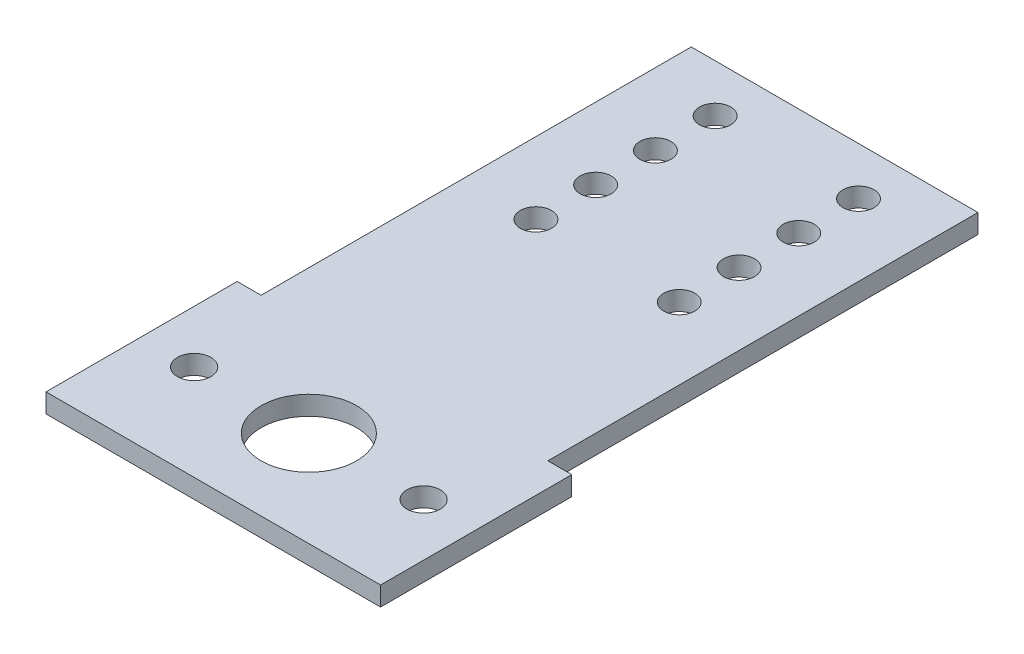
ISO-10303-21;
HEADER;
FILE_DESCRIPTION(('STEP AP214'),'2;1');
FILE_NAME('part.step','',(''),(''),'','','');
FILE_SCHEMA(('AUTOMOTIVE_DESIGN { 1 0 10303 214 1 1 1 1 }'));
ENDSEC;
DATA;
#1=APPLICATION_CONTEXT('core data for automotive mechanical design processes');
#2=APPLICATION_PROTOCOL_DEFINITION('international standard','automotive_design',2000,#1);
#3=PRODUCT_CONTEXT('',#1,'mechanical');
#4=PRODUCT('Part','Part','',(#3));
#5=PRODUCT_RELATED_PRODUCT_CATEGORY('part','',(#4));
#6=PRODUCT_DEFINITION_FORMATION('','',#4);
#7=PRODUCT_DEFINITION_CONTEXT('part definition',#1,'design');
#8=PRODUCT_DEFINITION('design','',#6,#7);
#9=PRODUCT_DEFINITION_SHAPE('','',#8);
#10=(LENGTH_UNIT() NAMED_UNIT(*) SI_UNIT(.MILLI.,.METRE.));
#11=(NAMED_UNIT(*) PLANE_ANGLE_UNIT() SI_UNIT($,.RADIAN.));
#12=(NAMED_UNIT(*) SI_UNIT($,.STERADIAN.) SOLID_ANGLE_UNIT());
#13=UNCERTAINTY_MEASURE_WITH_UNIT(LENGTH_MEASURE(1.E-05),#10,'distance_accuracy_value','');
#14=(GEOMETRIC_REPRESENTATION_CONTEXT(3) GLOBAL_UNCERTAINTY_ASSIGNED_CONTEXT((#13)) GLOBAL_UNIT_ASSIGNED_CONTEXT((#10,
#11,#12)) REPRESENTATION_CONTEXT('',''));
#15=CARTESIAN_POINT('',(0.,0.,0.));
#16=DIRECTION('',(0.,0.,1.));
#17=DIRECTION('',(1.,0.,0.));
#18=AXIS2_PLACEMENT_3D('',#15,#16,#17);
#19=CARTESIAN_POINT('',(-15.,0.,-17.5));
#20=DIRECTION('',(0.,1.,0.));
#21=DIRECTION('',(0.,0.,1.));
#22=AXIS2_PLACEMENT_3D('',#19,#20,#21);
#23=CYLINDRICAL_SURFACE('',#22,3.25);
#24=CARTESIAN_POINT('',(-15.,4.,-17.5));
#25=DIRECTION('',(0.,1.,0.));
#26=DIRECTION('',(0.,0.,1.));
#27=AXIS2_PLACEMENT_3D('',#24,#25,#26);
#28=CIRCLE('',#27,3.25);
#29=CARTESIAN_POINT('',(-15.,4.,-14.25));
#30=VERTEX_POINT('',#29);
#31=EDGE_CURVE('E39',#30,#30,#28,.T.);
#32=ORIENTED_EDGE('',*,*,#31,.T.);
#33=EDGE_LOOP('',(#32));
#34=FACE_BOUND('',#33,.T.);
#35=CARTESIAN_POINT('',(-15.,0.,-17.5));
#36=DIRECTION('',(0.,1.,0.));
#37=DIRECTION('',(0.,0.,1.));
#38=AXIS2_PLACEMENT_3D('',#35,#36,#37);
#39=CIRCLE('',#38,3.25);
#40=CARTESIAN_POINT('',(-15.,0.,-14.25));
#41=VERTEX_POINT('',#40);
#42=EDGE_CURVE('E11',#41,#41,#39,.T.);
#43=ORIENTED_EDGE('',*,*,#42,.F.);
#44=EDGE_LOOP('',(#43));
#45=FACE_BOUND('',#44,.T.);
#46=ADVANCED_FACE('F32',(#34,#45),#23,.F.);
#47=CARTESIAN_POINT('',(-15.,0.,-30.));
#48=DIRECTION('',(0.,1.,0.));
#49=DIRECTION('',(0.,0.,1.));
#50=AXIS2_PLACEMENT_3D('',#47,#48,#49);
#51=CYLINDRICAL_SURFACE('',#50,3.25);
#52=CARTESIAN_POINT('',(-15.,4.,-30.));
#53=DIRECTION('',(0.,1.,0.));
#54=DIRECTION('',(0.,0.,1.));
#55=AXIS2_PLACEMENT_3D('',#52,#53,#54);
#56=CIRCLE('',#55,3.25);
#57=CARTESIAN_POINT('',(-15.,4.,-26.75));
#58=VERTEX_POINT('',#57);
#59=EDGE_CURVE('E163',#58,#58,#56,.T.);
#60=ORIENTED_EDGE('',*,*,#59,.T.);
#61=EDGE_LOOP('',(#60));
#62=FACE_BOUND('',#61,.T.);
#63=CARTESIAN_POINT('',(-15.,0.,-30.));
#64=DIRECTION('',(0.,1.,0.));
#65=DIRECTION('',(0.,0.,1.));
#66=AXIS2_PLACEMENT_3D('',#63,#64,#65);
#67=CIRCLE('',#66,3.25);
#68=CARTESIAN_POINT('',(-15.,0.,-26.75));
#69=VERTEX_POINT('',#68);
#70=EDGE_CURVE('E166',#69,#69,#67,.T.);
#71=ORIENTED_EDGE('',*,*,#70,.F.);
#72=EDGE_LOOP('',(#71));
#73=FACE_BOUND('',#72,.T.);
#74=ADVANCED_FACE('F191',(#62,#73),#51,.F.);
#75=CARTESIAN_POINT('',(15.,0.,-17.5));
#76=DIRECTION('',(0.,1.,0.));
#77=DIRECTION('',(0.,0.,1.));
#78=AXIS2_PLACEMENT_3D('',#75,#76,#77);
#79=CYLINDRICAL_SURFACE('',#78,3.25);
#80=CARTESIAN_POINT('',(15.,4.,-17.5));
#81=DIRECTION('',(0.,1.,0.));
#82=DIRECTION('',(0.,0.,1.));
#83=AXIS2_PLACEMENT_3D('',#80,#81,#82);
#84=CIRCLE('',#83,3.25);
#85=CARTESIAN_POINT('',(15.,4.,-14.25));
#86=VERTEX_POINT('',#85);
#87=EDGE_CURVE('E157',#86,#86,#84,.T.);
#88=ORIENTED_EDGE('',*,*,#87,.T.);
#89=EDGE_LOOP('',(#88));
#90=FACE_BOUND('',#89,.T.);
#91=CARTESIAN_POINT('',(15.,0.,-17.5));
#92=DIRECTION('',(0.,1.,0.));
#93=DIRECTION('',(0.,0.,1.));
#94=AXIS2_PLACEMENT_3D('',#91,#92,#93);
#95=CIRCLE('',#94,3.25);
#96=CARTESIAN_POINT('',(15.,0.,-14.25));
#97=VERTEX_POINT('',#96);
#98=EDGE_CURVE('E160',#97,#97,#95,.T.);
#99=ORIENTED_EDGE('',*,*,#98,.F.);
#100=EDGE_LOOP('',(#99));
#101=FACE_BOUND('',#100,.T.);
#102=ADVANCED_FACE('F195',(#90,#101),#79,.F.);
#103=CARTESIAN_POINT('',(15.,0.,-30.));
#104=DIRECTION('',(0.,1.,0.));
#105=DIRECTION('',(0.,0.,1.));
#106=AXIS2_PLACEMENT_3D('',#103,#104,#105);
#107=CYLINDRICAL_SURFACE('',#106,3.25);
#108=CARTESIAN_POINT('',(15.,4.,-30.));
#109=DIRECTION('',(0.,1.,0.));
#110=DIRECTION('',(0.,0.,1.));
#111=AXIS2_PLACEMENT_3D('',#108,#109,#110);
#112=CIRCLE('',#111,3.25);
#113=CARTESIAN_POINT('',(15.,4.,-26.75));
#114=VERTEX_POINT('',#113);
#115=EDGE_CURVE('E151',#114,#114,#112,.T.);
#116=ORIENTED_EDGE('',*,*,#115,.T.);
#117=EDGE_LOOP('',(#116));
#118=FACE_BOUND('',#117,.T.);
#119=CARTESIAN_POINT('',(15.,0.,-30.));
#120=DIRECTION('',(0.,1.,0.));
#121=DIRECTION('',(0.,0.,1.));
#122=AXIS2_PLACEMENT_3D('',#119,#120,#121);
#123=CIRCLE('',#122,3.25);
#124=CARTESIAN_POINT('',(15.,0.,-26.75));
#125=VERTEX_POINT('',#124);
#126=EDGE_CURVE('E154',#125,#125,#123,.T.);
#127=ORIENTED_EDGE('',*,*,#126,.F.);
#128=EDGE_LOOP('',(#127));
#129=FACE_BOUND('',#128,.T.);
#130=ADVANCED_FACE('F200',(#118,#129),#107,.F.);
#131=CARTESIAN_POINT('',(30.,4.,-65.));
#132=DIRECTION('',(-1.,0.,0.));
#133=DIRECTION('',(0.,0.,1.));
#134=AXIS2_PLACEMENT_3D('',#131,#132,#133);
#135=PLANE('',#134);
#136=DIRECTION('',(0.,1.,0.));
#137=VECTOR('',#136,1.);
#138=CARTESIAN_POINT('',(30.,4.,25.));
#139=LINE('',#138,#137);
#140=CARTESIAN_POINT('',(30.,0.,25.));
#141=VERTEX_POINT('',#140);
#142=CARTESIAN_POINT('',(30.,4.,25.));
#143=VERTEX_POINT('',#142);
#144=EDGE_CURVE('E124',#141,#143,#139,.T.);
#145=ORIENTED_EDGE('',*,*,#144,.F.);
#146=DIRECTION('',(0.,0.,-1.));
#147=VECTOR('',#146,1.);
#148=CARTESIAN_POINT('',(30.,0.,-65.));
#149=LINE('',#148,#147);
#150=CARTESIAN_POINT('',(30.,0.,-65.));
#151=VERTEX_POINT('',#150);
#152=EDGE_CURVE('E131',#141,#151,#149,.T.);
#153=ORIENTED_EDGE('',*,*,#152,.T.);
#154=DIRECTION('',(0.,-1.,0.));
#155=VECTOR('',#154,1.);
#156=CARTESIAN_POINT('',(30.,4.,-65.));
#157=LINE('',#156,#155);
#158=CARTESIAN_POINT('',(30.,4.,-65.));
#159=VERTEX_POINT('',#158);
#160=EDGE_CURVE('E148',#159,#151,#157,.T.);
#161=ORIENTED_EDGE('',*,*,#160,.F.);
#162=DIRECTION('',(0.,0.,-1.));
#163=VECTOR('',#162,1.);
#164=CARTESIAN_POINT('',(30.,4.,-65.));
#165=LINE('',#164,#163);
#166=EDGE_CURVE('E54',#143,#159,#165,.T.);
#167=ORIENTED_EDGE('',*,*,#166,.F.);
#168=EDGE_LOOP('',(#145,#153,#161,#167));
#169=FACE_BOUND('',#168,.T.);
#170=ADVANCED_FACE('F207',(#169),#135,.F.);
#171=CARTESIAN_POINT('',(-30.,4.,-65.));
#172=DIRECTION('',(1.,0.,0.));
#173=DIRECTION('',(0.,0.,-1.));
#174=AXIS2_PLACEMENT_3D('',#171,#172,#173);
#175=PLANE('',#174);
#176=DIRECTION('',(0.,-1.,0.));
#177=VECTOR('',#176,1.);
#178=CARTESIAN_POINT('',(-30.,4.,25.));
#179=LINE('',#178,#177);
#180=CARTESIAN_POINT('',(-30.,4.,25.));
#181=VERTEX_POINT('',#180);
#182=CARTESIAN_POINT('',(-30.,0.,25.));
#183=VERTEX_POINT('',#182);
#184=EDGE_CURVE('E46',#181,#183,#179,.T.);
#185=ORIENTED_EDGE('',*,*,#184,.F.);
#186=DIRECTION('',(0.,0.,1.));
#187=VECTOR('',#186,1.);
#188=CARTESIAN_POINT('',(-30.,4.,-65.));
#189=LINE('',#188,#187);
#190=CARTESIAN_POINT('',(-30.,4.,-65.));
#191=VERTEX_POINT('',#190);
#192=EDGE_CURVE('E104',#191,#181,#189,.T.);
#193=ORIENTED_EDGE('',*,*,#192,.F.);
#194=DIRECTION('',(0.,-1.,0.));
#195=VECTOR('',#194,1.);
#196=CARTESIAN_POINT('',(-30.,4.,-65.));
#197=LINE('',#196,#195);
#198=CARTESIAN_POINT('',(-30.,0.,-65.));
#199=VERTEX_POINT('',#198);
#200=EDGE_CURVE('E139',#191,#199,#197,.T.);
#201=ORIENTED_EDGE('',*,*,#200,.T.);
#202=DIRECTION('',(0.,0.,1.));
#203=VECTOR('',#202,1.);
#204=CARTESIAN_POINT('',(-30.,0.,-65.));
#205=LINE('',#204,#203);
#206=EDGE_CURVE('E143',#199,#183,#205,.T.);
#207=ORIENTED_EDGE('',*,*,#206,.T.);
#208=EDGE_LOOP('',(#185,#193,#201,#207));
#209=FACE_BOUND('',#208,.T.);
#210=ADVANCED_FACE('F211',(#209),#175,.F.);
#211=CARTESIAN_POINT('',(-30.,4.,-65.));
#212=DIRECTION('',(0.,0.,1.));
#213=DIRECTION('',(1.,0.,0.));
#214=AXIS2_PLACEMENT_3D('',#211,#212,#213);
#215=PLANE('',#214);
#216=DIRECTION('',(-1.,0.,0.));
#217=VECTOR('',#216,1.);
#218=CARTESIAN_POINT('',(-30.,0.,-65.));
#219=LINE('',#218,#217);
#220=EDGE_CURVE('E141',#151,#199,#219,.T.);
#221=ORIENTED_EDGE('',*,*,#220,.T.);
#222=ORIENTED_EDGE('',*,*,#200,.F.);
#223=DIRECTION('',(-1.,0.,0.));
#224=VECTOR('',#223,1.);
#225=CARTESIAN_POINT('',(-30.,4.,-65.));
#226=LINE('',#225,#224);
#227=EDGE_CURVE('E133',#159,#191,#226,.T.);
#228=ORIENTED_EDGE('',*,*,#227,.F.);
#229=ORIENTED_EDGE('',*,*,#160,.T.);
#230=EDGE_LOOP('',(#221,#222,#228,#229));
#231=FACE_BOUND('',#230,.T.);
#232=ADVANCED_FACE('F184',(#231),#215,.F.);
#233=CARTESIAN_POINT('',(-30.,4.,65.));
#234=DIRECTION('',(0.,0.,-1.));
#235=DIRECTION('',(-1.,0.,0.));
#236=AXIS2_PLACEMENT_3D('',#233,#234,#235);
#237=PLANE('',#236);
#238=DIRECTION('',(1.,0.,0.));
#239=VECTOR('',#238,1.);
#240=CARTESIAN_POINT('',(-30.,0.,65.));
#241=LINE('',#240,#239);
#242=CARTESIAN_POINT('',(-35.,0.,65.));
#243=VERTEX_POINT('',#242);
#244=CARTESIAN_POINT('',(35.,0.,65.));
#245=VERTEX_POINT('',#244);
#246=EDGE_CURVE('E134',#243,#245,#241,.T.);
#247=ORIENTED_EDGE('',*,*,#246,.T.);
#248=DIRECTION('',(0.,-1.,0.));
#249=VECTOR('',#248,1.);
#250=CARTESIAN_POINT('',(35.,4.,65.));
#251=LINE('',#250,#249);
#252=CARTESIAN_POINT('',(35.,4.,65.));
#253=VERTEX_POINT('',#252);
#254=EDGE_CURVE('E126',#253,#245,#251,.T.);
#255=ORIENTED_EDGE('',*,*,#254,.F.);
#256=DIRECTION('',(1.,0.,0.));
#257=VECTOR('',#256,1.);
#258=CARTESIAN_POINT('',(-30.,4.,65.));
#259=LINE('',#258,#257);
#260=CARTESIAN_POINT('',(-35.,4.,65.));
#261=VERTEX_POINT('',#260);
#262=EDGE_CURVE('E137',#261,#253,#259,.T.);
#263=ORIENTED_EDGE('',*,*,#262,.F.);
#264=DIRECTION('',(0.,-1.,0.));
#265=VECTOR('',#264,1.);
#266=CARTESIAN_POINT('',(-35.,4.,65.));
#267=LINE('',#266,#265);
#268=EDGE_CURVE('E116',#261,#243,#267,.T.);
#269=ORIENTED_EDGE('',*,*,#268,.T.);
#270=EDGE_LOOP('',(#247,#255,#263,#269));
#271=FACE_BOUND('',#270,.T.);
#272=ADVANCED_FACE('F175',(#271),#237,.F.);
#273=CARTESIAN_POINT('',(0.,4.,0.));
#274=DIRECTION('',(0.,1.,0.));
#275=DIRECTION('',(0.,0.,1.));
#276=AXIS2_PLACEMENT_3D('',#273,#274,#275);
#277=PLANE('',#276);
#278=CARTESIAN_POINT('',(-15.,4.,-42.5));
#279=DIRECTION('',(0.,1.,0.));
#280=DIRECTION('',(0.,0.,1.));
#281=AXIS2_PLACEMENT_3D('',#278,#279,#280);
#282=CIRCLE('',#281,3.25);
#283=CARTESIAN_POINT('',(-15.,4.,-39.25));
#284=VERTEX_POINT('',#283);
#285=EDGE_CURVE('E372',#284,#284,#282,.T.);
#286=ORIENTED_EDGE('',*,*,#285,.F.);
#287=EDGE_LOOP('',(#286));
#288=FACE_BOUND('',#287,.T.);
#289=CARTESIAN_POINT('',(15.,4.,-42.5));
#290=DIRECTION('',(0.,1.,0.));
#291=DIRECTION('',(0.,0.,1.));
#292=AXIS2_PLACEMENT_3D('',#289,#290,#291);
#293=CIRCLE('',#292,3.25);
#294=CARTESIAN_POINT('',(15.,4.,-39.25));
#295=VERTEX_POINT('',#294);
#296=EDGE_CURVE('E376',#295,#295,#293,.T.);
#297=ORIENTED_EDGE('',*,*,#296,.F.);
#298=EDGE_LOOP('',(#297));
#299=FACE_BOUND('',#298,.T.);
#300=CARTESIAN_POINT('',(15.,4.,-55.));
#301=DIRECTION('',(0.,1.,0.));
#302=DIRECTION('',(0.,0.,1.));
#303=AXIS2_PLACEMENT_3D('',#300,#301,#302);
#304=CIRCLE('',#303,3.25);
#305=CARTESIAN_POINT('',(15.,4.,-51.75));
#306=VERTEX_POINT('',#305);
#307=EDGE_CURVE('E394',#306,#306,#304,.T.);
#308=ORIENTED_EDGE('',*,*,#307,.F.);
#309=EDGE_LOOP('',(#308));
#310=FACE_BOUND('',#309,.T.);
#311=CARTESIAN_POINT('',(-15.,4.,-55.));
#312=DIRECTION('',(0.,1.,0.));
#313=DIRECTION('',(0.,0.,1.));
#314=AXIS2_PLACEMENT_3D('',#311,#312,#313);
#315=CIRCLE('',#314,3.25);
#316=CARTESIAN_POINT('',(-15.,4.,-51.75));
#317=VERTEX_POINT('',#316);
#318=EDGE_CURVE('E389',#317,#317,#315,.T.);
#319=ORIENTED_EDGE('',*,*,#318,.F.);
#320=EDGE_LOOP('',(#319));
#321=FACE_BOUND('',#320,.T.);
#322=CARTESIAN_POINT('',(-24.,4.,45.));
#323=DIRECTION('',(0.,1.,0.));
#324=DIRECTION('',(0.,0.,1.));
#325=AXIS2_PLACEMENT_3D('',#322,#323,#324);
#326=CIRCLE('',#325,3.5);
#327=CARTESIAN_POINT('',(-24.,4.,48.5));
#328=VERTEX_POINT('',#327);
#329=EDGE_CURVE('E401',#328,#328,#326,.T.);
#330=ORIENTED_EDGE('',*,*,#329,.F.);
#331=EDGE_LOOP('',(#330));
#332=FACE_BOUND('',#331,.T.);
#333=CARTESIAN_POINT('',(0.,4.,45.));
#334=DIRECTION('',(0.,1.,0.));
#335=DIRECTION('',(0.,0.,1.));
#336=AXIS2_PLACEMENT_3D('',#333,#334,#335);
#337=CIRCLE('',#336,10.);
#338=CARTESIAN_POINT('',(0.,4.,55.));
#339=VERTEX_POINT('',#338);
#340=EDGE_CURVE('E404',#339,#339,#337,.T.);
#341=ORIENTED_EDGE('',*,*,#340,.F.);
#342=EDGE_LOOP('',(#341));
#343=FACE_BOUND('',#342,.T.);
#344=CARTESIAN_POINT('',(24.,4.,45.));
#345=DIRECTION('',(0.,1.,0.));
#346=DIRECTION('',(0.,0.,1.));
#347=AXIS2_PLACEMENT_3D('',#344,#345,#346);
#348=CIRCLE('',#347,3.5);
#349=CARTESIAN_POINT('',(24.,4.,48.5));
#350=VERTEX_POINT('',#349);
#351=EDGE_CURVE('E410',#350,#350,#348,.T.);
#352=ORIENTED_EDGE('',*,*,#351,.F.);
#353=EDGE_LOOP('',(#352));
#354=FACE_BOUND('',#353,.T.);
#355=ORIENTED_EDGE('',*,*,#262,.T.);
#356=DIRECTION('',(0.,0.,-1.));
#357=VECTOR('',#356,1.);
#358=CARTESIAN_POINT('',(35.,4.,25.));
#359=LINE('',#358,#357);
#360=CARTESIAN_POINT('',(35.,4.,25.));
#361=VERTEX_POINT('',#360);
#362=EDGE_CURVE('E117',#253,#361,#359,.T.);
#363=ORIENTED_EDGE('',*,*,#362,.T.);
#364=DIRECTION('',(-1.,0.,0.));
#365=VECTOR('',#364,1.);
#366=CARTESIAN_POINT('',(-35.,4.,25.));
#367=LINE('',#366,#365);
#368=EDGE_CURVE('E107',#361,#143,#367,.T.);
#369=ORIENTED_EDGE('',*,*,#368,.T.);
#370=ORIENTED_EDGE('',*,*,#166,.T.);
#371=ORIENTED_EDGE('',*,*,#227,.T.);
#372=ORIENTED_EDGE('',*,*,#192,.T.);
#373=CARTESIAN_POINT('',(-35.,4.,25.));
#374=VERTEX_POINT('',#373);
#375=EDGE_CURVE('E98',#181,#374,#367,.T.);
#376=ORIENTED_EDGE('',*,*,#375,.T.);
#377=DIRECTION('',(0.,0.,1.));
#378=VECTOR('',#377,1.);
#379=CARTESIAN_POINT('',(-35.,4.,25.));
#380=LINE('',#379,#378);
#381=EDGE_CURVE('E102',#374,#261,#380,.T.);
#382=ORIENTED_EDGE('',*,*,#381,.T.);
#383=EDGE_LOOP('',(#355,#363,#369,#370,#371,#372,#376,#382));
#384=FACE_BOUND('',#383,.T.);
#385=ORIENTED_EDGE('',*,*,#115,.F.);
#386=EDGE_LOOP('',(#385));
#387=FACE_BOUND('',#386,.T.);
#388=ORIENTED_EDGE('',*,*,#87,.F.);
#389=EDGE_LOOP('',(#388));
#390=FACE_BOUND('',#389,.T.);
#391=ORIENTED_EDGE('',*,*,#59,.F.);
#392=EDGE_LOOP('',(#391));
#393=FACE_BOUND('',#392,.T.);
#394=ORIENTED_EDGE('',*,*,#31,.F.);
#395=EDGE_LOOP('',(#394));
#396=FACE_BOUND('',#395,.T.);
#397=ADVANCED_FACE('F100',(#288,#299,#310,#321,#332,#343,#354,#384,#387,#390,#393,#396),#277,.T.);
#398=CARTESIAN_POINT('',(0.,0.,0.));
#399=DIRECTION('',(0.,1.,0.));
#400=DIRECTION('',(0.,0.,1.));
#401=AXIS2_PLACEMENT_3D('',#398,#399,#400);
#402=PLANE('',#401);
#403=CARTESIAN_POINT('',(-15.,0.,-42.5));
#404=DIRECTION('',(0.,1.,0.));
#405=DIRECTION('',(0.,0.,1.));
#406=AXIS2_PLACEMENT_3D('',#403,#404,#405);
#407=CIRCLE('',#406,3.25);
#408=CARTESIAN_POINT('',(-15.,0.,-39.25));
#409=VERTEX_POINT('',#408);
#410=EDGE_CURVE('E375',#409,#409,#407,.T.);
#411=ORIENTED_EDGE('',*,*,#410,.T.);
#412=EDGE_LOOP('',(#411));
#413=FACE_BOUND('',#412,.T.);
#414=CARTESIAN_POINT('',(15.,0.,-42.5));
#415=DIRECTION('',(0.,1.,0.));
#416=DIRECTION('',(0.,0.,1.));
#417=AXIS2_PLACEMENT_3D('',#414,#415,#416);
#418=CIRCLE('',#417,3.25);
#419=CARTESIAN_POINT('',(15.,0.,-39.25));
#420=VERTEX_POINT('',#419);
#421=EDGE_CURVE('E379',#420,#420,#418,.T.);
#422=ORIENTED_EDGE('',*,*,#421,.T.);
#423=EDGE_LOOP('',(#422));
#424=FACE_BOUND('',#423,.T.);
#425=CARTESIAN_POINT('',(15.,0.,-55.));
#426=DIRECTION('',(0.,1.,0.));
#427=DIRECTION('',(0.,0.,1.));
#428=AXIS2_PLACEMENT_3D('',#425,#426,#427);
#429=CIRCLE('',#428,3.25);
#430=CARTESIAN_POINT('',(15.,0.,-51.75));
#431=VERTEX_POINT('',#430);
#432=EDGE_CURVE('E386',#431,#431,#429,.T.);
#433=ORIENTED_EDGE('',*,*,#432,.T.);
#434=EDGE_LOOP('',(#433));
#435=FACE_BOUND('',#434,.T.);
#436=CARTESIAN_POINT('',(-15.,0.,-55.));
#437=DIRECTION('',(0.,1.,0.));
#438=DIRECTION('',(0.,0.,1.));
#439=AXIS2_PLACEMENT_3D('',#436,#437,#438);
#440=CIRCLE('',#439,3.25);
#441=CARTESIAN_POINT('',(-15.,0.,-51.75));
#442=VERTEX_POINT('',#441);
#443=EDGE_CURVE('E385',#442,#442,#440,.T.);
#444=ORIENTED_EDGE('',*,*,#443,.T.);
#445=EDGE_LOOP('',(#444));
#446=FACE_BOUND('',#445,.T.);
#447=CARTESIAN_POINT('',(-24.,0.,45.));
#448=DIRECTION('',(0.,1.,0.));
#449=DIRECTION('',(0.,0.,1.));
#450=AXIS2_PLACEMENT_3D('',#447,#448,#449);
#451=CIRCLE('',#450,3.5);
#452=CARTESIAN_POINT('',(-24.,0.,48.5));
#453=VERTEX_POINT('',#452);
#454=EDGE_CURVE('E398',#453,#453,#451,.T.);
#455=ORIENTED_EDGE('',*,*,#454,.T.);
#456=EDGE_LOOP('',(#455));
#457=FACE_BOUND('',#456,.T.);
#458=CARTESIAN_POINT('',(0.,0.,45.));
#459=DIRECTION('',(0.,1.,0.));
#460=DIRECTION('',(0.,0.,1.));
#461=AXIS2_PLACEMENT_3D('',#458,#459,#460);
#462=CIRCLE('',#461,10.);
#463=CARTESIAN_POINT('',(0.,0.,55.));
#464=VERTEX_POINT('',#463);
#465=EDGE_CURVE('E407',#464,#464,#462,.T.);
#466=ORIENTED_EDGE('',*,*,#465,.T.);
#467=EDGE_LOOP('',(#466));
#468=FACE_BOUND('',#467,.T.);
#469=CARTESIAN_POINT('',(24.,0.,45.));
#470=DIRECTION('',(0.,1.,0.));
#471=DIRECTION('',(0.,0.,1.));
#472=AXIS2_PLACEMENT_3D('',#469,#470,#471);
#473=CIRCLE('',#472,3.5);
#474=CARTESIAN_POINT('',(24.,0.,48.5));
#475=VERTEX_POINT('',#474);
#476=EDGE_CURVE('E397',#475,#475,#473,.T.);
#477=ORIENTED_EDGE('',*,*,#476,.T.);
#478=EDGE_LOOP('',(#477));
#479=FACE_BOUND('',#478,.T.);
#480=ORIENTED_EDGE('',*,*,#246,.F.);
#481=DIRECTION('',(0.,0.,1.));
#482=VECTOR('',#481,1.);
#483=CARTESIAN_POINT('',(-35.,0.,25.));
#484=LINE('',#483,#482);
#485=CARTESIAN_POINT('',(-35.,0.,25.));
#486=VERTEX_POINT('',#485);
#487=EDGE_CURVE('E421',#486,#243,#484,.T.);
#488=ORIENTED_EDGE('',*,*,#487,.F.);
#489=DIRECTION('',(-1.,0.,0.));
#490=VECTOR('',#489,1.);
#491=CARTESIAN_POINT('',(-35.,0.,25.));
#492=LINE('',#491,#490);
#493=EDGE_CURVE('E121',#183,#486,#492,.T.);
#494=ORIENTED_EDGE('',*,*,#493,.F.);
#495=ORIENTED_EDGE('',*,*,#206,.F.);
#496=ORIENTED_EDGE('',*,*,#220,.F.);
#497=ORIENTED_EDGE('',*,*,#152,.F.);
#498=CARTESIAN_POINT('',(35.,0.,25.));
#499=VERTEX_POINT('',#498);
#500=EDGE_CURVE('E418',#499,#141,#492,.T.);
#501=ORIENTED_EDGE('',*,*,#500,.F.);
#502=DIRECTION('',(0.,0.,-1.));
#503=VECTOR('',#502,1.);
#504=CARTESIAN_POINT('',(35.,0.,25.));
#505=LINE('',#504,#503);
#506=EDGE_CURVE('E108',#245,#499,#505,.T.);
#507=ORIENTED_EDGE('',*,*,#506,.F.);
#508=EDGE_LOOP('',(#480,#488,#494,#495,#496,#497,#501,#507));
#509=FACE_BOUND('',#508,.T.);
#510=ORIENTED_EDGE('',*,*,#126,.T.);
#511=EDGE_LOOP('',(#510));
#512=FACE_BOUND('',#511,.T.);
#513=ORIENTED_EDGE('',*,*,#98,.T.);
#514=EDGE_LOOP('',(#513));
#515=FACE_BOUND('',#514,.T.);
#516=ORIENTED_EDGE('',*,*,#70,.T.);
#517=EDGE_LOOP('',(#516));
#518=FACE_BOUND('',#517,.T.);
#519=ORIENTED_EDGE('',*,*,#42,.T.);
#520=EDGE_LOOP('',(#519));
#521=FACE_BOUND('',#520,.T.);
#522=ADVANCED_FACE('F174',(#413,#424,#435,#446,#457,#468,#479,#509,#512,#515,#518,#521),#402,.F.);
#523=CARTESIAN_POINT('',(-35.,4.,25.));
#524=DIRECTION('',(1.,0.,0.));
#525=DIRECTION('',(0.,0.,-1.));
#526=AXIS2_PLACEMENT_3D('',#523,#524,#525);
#527=PLANE('',#526);
#528=ORIENTED_EDGE('',*,*,#487,.T.);
#529=ORIENTED_EDGE('',*,*,#268,.F.);
#530=ORIENTED_EDGE('',*,*,#381,.F.);
#531=DIRECTION('',(0.,-1.,0.));
#532=VECTOR('',#531,1.);
#533=CARTESIAN_POINT('',(-35.,4.,25.));
#534=LINE('',#533,#532);
#535=EDGE_CURVE('E114',#374,#486,#534,.T.);
#536=ORIENTED_EDGE('',*,*,#535,.T.);
#537=EDGE_LOOP('',(#528,#529,#530,#536));
#538=FACE_BOUND('',#537,.T.);
#539=ADVANCED_FACE('F113',(#538),#527,.F.);
#540=CARTESIAN_POINT('',(-35.,4.,25.));
#541=DIRECTION('',(0.,0.,1.));
#542=DIRECTION('',(1.,0.,0.));
#543=AXIS2_PLACEMENT_3D('',#540,#541,#542);
#544=PLANE('',#543);
#545=ORIENTED_EDGE('',*,*,#375,.F.);
#546=ORIENTED_EDGE('',*,*,#184,.T.);
#547=ORIENTED_EDGE('',*,*,#493,.T.);
#548=ORIENTED_EDGE('',*,*,#535,.F.);
#549=EDGE_LOOP('',(#545,#546,#547,#548));
#550=FACE_BOUND('',#549,.T.);
#551=ADVANCED_FACE('F119',(#550),#544,.F.);
#552=ORIENTED_EDGE('',*,*,#500,.T.);
#553=ORIENTED_EDGE('',*,*,#144,.T.);
#554=ORIENTED_EDGE('',*,*,#368,.F.);
#555=DIRECTION('',(0.,-1.,0.));
#556=VECTOR('',#555,1.);
#557=CARTESIAN_POINT('',(35.,4.,25.));
#558=LINE('',#557,#556);
#559=EDGE_CURVE('E417',#361,#499,#558,.T.);
#560=ORIENTED_EDGE('',*,*,#559,.T.);
#561=EDGE_LOOP('',(#552,#553,#554,#560));
#562=FACE_BOUND('',#561,.T.);
#563=ADVANCED_FACE('F249',(#562),#544,.F.);
#564=CARTESIAN_POINT('',(35.,4.,25.));
#565=DIRECTION('',(-1.,0.,0.));
#566=DIRECTION('',(0.,0.,1.));
#567=AXIS2_PLACEMENT_3D('',#564,#565,#566);
#568=PLANE('',#567);
#569=ORIENTED_EDGE('',*,*,#506,.T.);
#570=ORIENTED_EDGE('',*,*,#559,.F.);
#571=ORIENTED_EDGE('',*,*,#362,.F.);
#572=ORIENTED_EDGE('',*,*,#254,.T.);
#573=EDGE_LOOP('',(#569,#570,#571,#572));
#574=FACE_BOUND('',#573,.T.);
#575=ADVANCED_FACE('F257',(#574),#568,.F.);
#576=CARTESIAN_POINT('',(24.,0.,45.));
#577=DIRECTION('',(0.,1.,0.));
#578=DIRECTION('',(0.,0.,1.));
#579=AXIS2_PLACEMENT_3D('',#576,#577,#578);
#580=CYLINDRICAL_SURFACE('',#579,3.5);
#581=ORIENTED_EDGE('',*,*,#476,.F.);
#582=EDGE_LOOP('',(#581));
#583=FACE_BOUND('',#582,.T.);
#584=ORIENTED_EDGE('',*,*,#351,.T.);
#585=EDGE_LOOP('',(#584));
#586=FACE_BOUND('',#585,.T.);
#587=ADVANCED_FACE('F266',(#583,#586),#580,.F.);
#588=CARTESIAN_POINT('',(0.,0.,45.));
#589=DIRECTION('',(0.,1.,0.));
#590=DIRECTION('',(0.,0.,1.));
#591=AXIS2_PLACEMENT_3D('',#588,#589,#590);
#592=CYLINDRICAL_SURFACE('',#591,10.);
#593=ORIENTED_EDGE('',*,*,#465,.F.);
#594=EDGE_LOOP('',(#593));
#595=FACE_BOUND('',#594,.T.);
#596=ORIENTED_EDGE('',*,*,#340,.T.);
#597=EDGE_LOOP('',(#596));
#598=FACE_BOUND('',#597,.T.);
#599=ADVANCED_FACE('F276',(#595,#598),#592,.F.);
#600=CARTESIAN_POINT('',(-24.,0.,45.));
#601=DIRECTION('',(0.,1.,0.));
#602=DIRECTION('',(0.,0.,1.));
#603=AXIS2_PLACEMENT_3D('',#600,#601,#602);
#604=CYLINDRICAL_SURFACE('',#603,3.5);
#605=ORIENTED_EDGE('',*,*,#454,.F.);
#606=EDGE_LOOP('',(#605));
#607=FACE_BOUND('',#606,.T.);
#608=ORIENTED_EDGE('',*,*,#329,.T.);
#609=EDGE_LOOP('',(#608));
#610=FACE_BOUND('',#609,.T.);
#611=ADVANCED_FACE('F286',(#607,#610),#604,.F.);
#612=CARTESIAN_POINT('',(-15.,0.,-55.));
#613=DIRECTION('',(0.,1.,0.));
#614=DIRECTION('',(0.,0.,1.));
#615=AXIS2_PLACEMENT_3D('',#612,#613,#614);
#616=CYLINDRICAL_SURFACE('',#615,3.25);
#617=ORIENTED_EDGE('',*,*,#318,.T.);
#618=EDGE_LOOP('',(#617));
#619=FACE_BOUND('',#618,.T.);
#620=ORIENTED_EDGE('',*,*,#443,.F.);
#621=EDGE_LOOP('',(#620));
#622=FACE_BOUND('',#621,.T.);
#623=ADVANCED_FACE('F296',(#619,#622),#616,.F.);
#624=CARTESIAN_POINT('',(15.,0.,-55.));
#625=DIRECTION('',(0.,1.,0.));
#626=DIRECTION('',(0.,0.,1.));
#627=AXIS2_PLACEMENT_3D('',#624,#625,#626);
#628=CYLINDRICAL_SURFACE('',#627,3.25);
#629=ORIENTED_EDGE('',*,*,#307,.T.);
#630=EDGE_LOOP('',(#629));
#631=FACE_BOUND('',#630,.T.);
#632=ORIENTED_EDGE('',*,*,#432,.F.);
#633=EDGE_LOOP('',(#632));
#634=FACE_BOUND('',#633,.T.);
#635=ADVANCED_FACE('F306',(#631,#634),#628,.F.);
#636=CARTESIAN_POINT('',(15.,0.,-42.5));
#637=DIRECTION('',(0.,1.,0.));
#638=DIRECTION('',(0.,0.,1.));
#639=AXIS2_PLACEMENT_3D('',#636,#637,#638);
#640=CYLINDRICAL_SURFACE('',#639,3.25);
#641=ORIENTED_EDGE('',*,*,#296,.T.);
#642=EDGE_LOOP('',(#641));
#643=FACE_BOUND('',#642,.T.);
#644=ORIENTED_EDGE('',*,*,#421,.F.);
#645=EDGE_LOOP('',(#644));
#646=FACE_BOUND('',#645,.T.);
#647=ADVANCED_FACE('F315',(#643,#646),#640,.F.);
#648=CARTESIAN_POINT('',(-15.,0.,-42.5));
#649=DIRECTION('',(0.,1.,0.));
#650=DIRECTION('',(0.,0.,1.));
#651=AXIS2_PLACEMENT_3D('',#648,#649,#650);
#652=CYLINDRICAL_SURFACE('',#651,3.25);
#653=ORIENTED_EDGE('',*,*,#285,.T.);
#654=EDGE_LOOP('',(#653));
#655=FACE_BOUND('',#654,.T.);
#656=ORIENTED_EDGE('',*,*,#410,.F.);
#657=EDGE_LOOP('',(#656));
#658=FACE_BOUND('',#657,.T.);
#659=ADVANCED_FACE('F356',(#655,#658),#652,.F.);
#660=CLOSED_SHELL('',(#46,#74,#102,#130,#170,#210,#232,#272,#397,#522,#539,#551,#563,#575,#587,
#599,#611,#623,#635,#647,#659));
#661=MANIFOLD_SOLID_BREP('B2',#660);
#662=ADVANCED_BREP_SHAPE_REPRESENTATION('',(#18,#661),#14);
#663=SHAPE_DEFINITION_REPRESENTATION(#9,#662);
ENDSEC;
END-ISO-10303-21;
